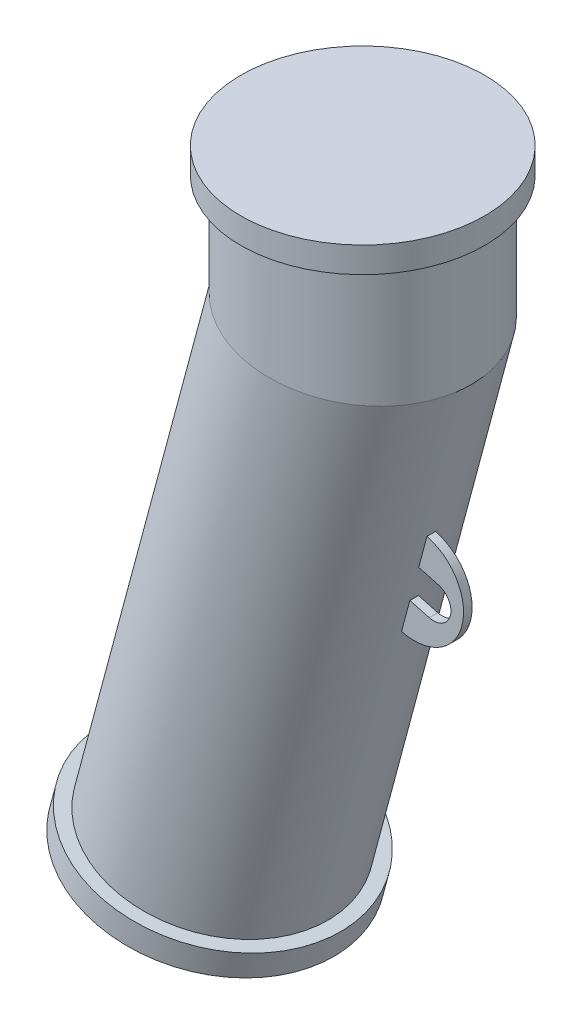
ISO-10303-21;
HEADER;
FILE_DESCRIPTION(('STEP AP214'),'2;1');
FILE_NAME('part.step','',(''),(''),'','','');
FILE_SCHEMA(('AUTOMOTIVE_DESIGN { 1 0 10303 214 1 1 1 1 }'));
ENDSEC;
DATA;
#1=APPLICATION_CONTEXT('core data for automotive mechanical design processes');
#2=APPLICATION_PROTOCOL_DEFINITION('international standard','automotive_design',2000,#1);
#3=PRODUCT_CONTEXT('',#1,'mechanical');
#4=PRODUCT('Part','Part','',(#3));
#5=PRODUCT_RELATED_PRODUCT_CATEGORY('part','',(#4));
#6=PRODUCT_DEFINITION_FORMATION('','',#4);
#7=PRODUCT_DEFINITION_CONTEXT('part definition',#1,'design');
#8=PRODUCT_DEFINITION('design','',#6,#7);
#9=PRODUCT_DEFINITION_SHAPE('','',#8);
#10=(LENGTH_UNIT() NAMED_UNIT(*) SI_UNIT(.MILLI.,.METRE.));
#11=(NAMED_UNIT(*) PLANE_ANGLE_UNIT() SI_UNIT($,.RADIAN.));
#12=(NAMED_UNIT(*) SI_UNIT($,.STERADIAN.) SOLID_ANGLE_UNIT());
#13=UNCERTAINTY_MEASURE_WITH_UNIT(LENGTH_MEASURE(1.E-05),#10,'distance_accuracy_value','');
#14=(GEOMETRIC_REPRESENTATION_CONTEXT(3) GLOBAL_UNCERTAINTY_ASSIGNED_CONTEXT((#13)) GLOBAL_UNIT_ASSIGNED_CONTEXT((#10,
#11,#12)) REPRESENTATION_CONTEXT('',''));
#15=CARTESIAN_POINT('',(0.,0.,0.));
#16=DIRECTION('',(0.,0.,1.));
#17=DIRECTION('',(1.,0.,0.));
#18=AXIS2_PLACEMENT_3D('',#15,#16,#17);
#19=CARTESIAN_POINT('',(0.,-131.652497587396,0.));
#20=DIRECTION('',(0.,1.,0.));
#21=DIRECTION('',(0.,0.,1.));
#22=AXIS2_PLACEMENT_3D('',#19,#20,#21);
#23=CYLINDRICAL_SURFACE('',#22,127.);
#24=CARTESIAN_POINT('',(0.,0.,0.));
#25=DIRECTION('',(0.,-1.,0.));
#26=DIRECTION('',(0.,0.,-1.));
#27=AXIS2_PLACEMENT_3D('',#24,#25,#26);
#28=CIRCLE('',#27,127.);
#29=CARTESIAN_POINT('',(0.,0.,-127.));
#30=VERTEX_POINT('',#29);
#31=EDGE_CURVE('E313',#30,#30,#28,.T.);
#32=ORIENTED_EDGE('',*,*,#31,.T.);
#33=EDGE_LOOP('',(#32));
#34=FACE_BOUND('',#33,.T.);
#35=CARTESIAN_POINT('',(1.04083408558608E-13,-131.652497587397,0.));
#36=DIRECTION('',(0.130526192220052,0.991444861373811,0.));
#37=DIRECTION('',(0.991444861373811,-0.130526192220052,0.));
#38=AXIS2_PLACEMENT_3D('',#35,#36,#37);
#39=ELLIPSE('',#38,128.095877993679,127.);
#40=CARTESIAN_POINT('',(127.,-148.372364780996,0.));
#41=VERTEX_POINT('',#40);
#42=EDGE_CURVE('E321',#41,#41,#39,.T.);
#43=ORIENTED_EDGE('',*,*,#42,.T.);
#44=EDGE_LOOP('',(#43));
#45=FACE_BOUND('',#44,.T.);
#46=ADVANCED_FACE('F17',(#34,#45),#23,.T.);
#47=CARTESIAN_POINT('',(-95.6613645989107,-759.954897245026,29.0839408597498));
#48=DIRECTION('',(-0.258819045102509,-0.965925826289071,0.));
#49=DIRECTION('',(0.369643810614398,-0.0990457605412854,-0.923879532511311));
#50=AXIS2_PLACEMENT_3D('',#47,#48,#49);
#51=PLANE('',#50);
#52=CARTESIAN_POINT('',(-163.483696262193,-741.781958247057,0.));
#53=DIRECTION('',(-0.258819045102522,-0.965925826289069,0.));
#54=DIRECTION('',(0.,0.,-1.));
#55=AXIS2_PLACEMENT_3D('',#52,#53,#54);
#56=CIRCLE('',#55,127.);
#57=CARTESIAN_POINT('',(-163.483696262193,-741.781958247057,-127.));
#58=VERTEX_POINT('',#57);
#59=EDGE_CURVE('E317',#58,#58,#56,.T.);
#60=ORIENTED_EDGE('',*,*,#59,.T.);
#61=EDGE_LOOP('',(#60));
#62=FACE_BOUND('',#61,.T.);
#63=CARTESIAN_POINT('',(-163.483696262181,-741.781958247051,1.54839771410055E-12));
#64=DIRECTION('',(0.258819045102509,0.965925826289071,0.));
#65=DIRECTION('',(-0.369643810614398,0.0990457605412854,0.923879532511311));
#66=AXIS2_PLACEMENT_3D('',#63,#64,#65);
#67=CIRCLE('',#66,142.5);
#68=CARTESIAN_POINT('',(-216.157939274733,-727.667937369918,131.652833382863));
#69=VERTEX_POINT('',#68);
#70=EDGE_CURVE('E309',#69,#69,#67,.T.);
#71=ORIENTED_EDGE('',*,*,#70,.T.);
#72=EDGE_LOOP('',(#71));
#73=FACE_BOUND('',#72,.T.);
#74=ADVANCED_FACE('F392',(#62,#73),#51,.F.);
#75=CARTESIAN_POINT('',(-163.483696262181,-741.781958247051,1.54839771410055E-12));
#76=DIRECTION('',(0.258819045102509,0.965925826289071,0.));
#77=DIRECTION('',(-0.369643810614398,0.0990457605412854,0.923879532511311));
#78=AXIS2_PLACEMENT_3D('',#75,#76,#77);
#79=CYLINDRICAL_SURFACE('',#78,142.5);
#80=ORIENTED_EDGE('',*,*,#70,.F.);
#81=EDGE_LOOP('',(#80));
#82=FACE_BOUND('',#81,.T.);
#83=CARTESIAN_POINT('',(-171.248267615256,-770.759733035724,2.84822651057021E-12));
#84=DIRECTION('',(0.258819045102509,0.965925826289071,0.));
#85=DIRECTION('',(-0.369643810614398,0.0990457605412854,0.923879532511311));
#86=AXIS2_PLACEMENT_3D('',#83,#84,#85);
#87=CIRCLE('',#86,142.5);
#88=CARTESIAN_POINT('',(-223.922510627808,-756.645712158591,131.652833382865));
#89=VERTEX_POINT('',#88);
#90=EDGE_CURVE('E305',#89,#89,#87,.T.);
#91=ORIENTED_EDGE('',*,*,#90,.T.);
#92=EDGE_LOOP('',(#91));
#93=FACE_BOUND('',#92,.T.);
#94=ADVANCED_FACE('F398',(#82,#93),#79,.T.);
#95=CARTESIAN_POINT('',(-44.0813957466201,-804.833993656921,54.5323891120309));
#96=DIRECTION('',(0.258819045102509,0.965925826289071,0.));
#97=DIRECTION('',(-0.369643810614398,0.0990457605412854,0.923879532511311));
#98=AXIS2_PLACEMENT_3D('',#95,#96,#97);
#99=PLANE('',#98);
#100=ORIENTED_EDGE('',*,*,#90,.F.);
#101=EDGE_LOOP('',(#100));
#102=FACE_BOUND('',#101,.T.);
#103=ADVANCED_FACE('F404',(#102),#99,.F.);
#104=CARTESIAN_POINT('',(-70.2148444708591,7.111762575851E-12,-29.0839408597463));
#105=DIRECTION('',(0.,0.999999999999999,0.));
#106=DIRECTION('',(0.382683432365101,0.,-0.923879532511311));
#107=AXIS2_PLACEMENT_3D('',#104,#105,#106);
#108=PLANE('',#107);
#109=ORIENTED_EDGE('',*,*,#31,.F.);
#110=EDGE_LOOP('',(#109));
#111=FACE_BOUND('',#110,.T.);
#112=CARTESIAN_POINT('',(0.,0.,0.));
#113=DIRECTION('',(0.,-0.999999999999999,0.));
#114=DIRECTION('',(-0.382683432365101,0.,0.923879532511311));
#115=AXIS2_PLACEMENT_3D('',#112,#113,#114);
#116=CIRCLE('',#115,142.5);
#117=CARTESIAN_POINT('',(-54.5323891120268,0.,131.652833382862));
#118=VERTEX_POINT('',#117);
#119=EDGE_CURVE('E301',#118,#118,#116,.T.);
#120=ORIENTED_EDGE('',*,*,#119,.T.);
#121=EDGE_LOOP('',(#120));
#122=FACE_BOUND('',#121,.T.);
#123=ADVANCED_FACE('F408',(#111,#122),#108,.F.);
#124=CARTESIAN_POINT('',(0.,0.,0.));
#125=DIRECTION('',(0.,-0.999999999999999,0.));
#126=DIRECTION('',(-0.382683432365101,0.,0.923879532511311));
#127=AXIS2_PLACEMENT_3D('',#124,#125,#126);
#128=CYLINDRICAL_SURFACE('',#127,142.5);
#129=ORIENTED_EDGE('',*,*,#119,.F.);
#130=EDGE_LOOP('',(#129));
#131=FACE_BOUND('',#130,.T.);
#132=CARTESIAN_POINT('',(-1.51753841493357E-12,30.0000000000011,3.33871122390185E-13));
#133=DIRECTION('',(0.,-0.999999999999999,0.));
#134=DIRECTION('',(-0.382683432365101,0.,0.923879532511311));
#135=AXIS2_PLACEMENT_3D('',#132,#133,#134);
#136=CIRCLE('',#135,142.5);
#137=CARTESIAN_POINT('',(-54.5323891120284,30.0000000000011,131.652833382862));
#138=VERTEX_POINT('',#137);
#139=EDGE_CURVE('E297',#138,#138,#136,.T.);
#140=ORIENTED_EDGE('',*,*,#139,.T.);
#141=EDGE_LOOP('',(#140));
#142=FACE_BOUND('',#141,.T.);
#143=ADVANCED_FACE('F412',(#131,#142),#128,.T.);
#144=CARTESIAN_POINT('',(-131.652833382864,30.0000000000066,-54.5323891120249));
#145=DIRECTION('',(0.,-0.999999999999999,0.));
#146=DIRECTION('',(-0.382683432365101,0.,0.923879532511311));
#147=AXIS2_PLACEMENT_3D('',#144,#145,#146);
#148=PLANE('',#147);
#149=ORIENTED_EDGE('',*,*,#139,.F.);
#150=EDGE_LOOP('',(#149));
#151=FACE_BOUND('',#150,.T.);
#152=ADVANCED_FACE('F386',(#151),#148,.F.);
#153=CARTESIAN_POINT('',(-163.483696262193,-741.781958247057,0.));
#154=DIRECTION('',(0.258819045102522,0.965925826289069,0.));
#155=DIRECTION('',(-0.965925826289069,0.258819045102522,0.));
#156=AXIS2_PLACEMENT_3D('',#153,#154,#155);
#157=CYLINDRICAL_SURFACE('',#156,127.);
#158=CARTESIAN_POINT('',(50.327510586392,-434.137557581643,5.00000000000004));
#159=CARTESIAN_POINT('',(50.3909015789029,-434.154601332666,3.33333333333338));
#160=CARTESIAN_POINT('',(50.4225970751584,-434.163123208177,1.66666666666671));
#161=CARTESIAN_POINT('',(50.4225970751584,-434.163123208177,-1.66666666666662));
#162=CARTESIAN_POINT('',(50.390901578903,-434.154601332666,-3.33333333333329));
#163=CARTESIAN_POINT('',(50.327510586392,-434.137557581643,-4.99999999999996));
#164=B_SPLINE_CURVE_WITH_KNOTS('',3,(#158,#159,#160,#161,#162,#163),.UNSPECIFIED.,.F.,.F.,(4,2,
4),(0.,5.00096941018499,10.00193882037),.UNSPECIFIED.);
#165=CARTESIAN_POINT('',(50.327510586392,-434.137557581643,5.00000000000004));
#166=VERTEX_POINT('',#165);
#167=CARTESIAN_POINT('',(50.3275105863922,-434.137557581643,-4.99999999999996));
#168=VERTEX_POINT('',#167);
#169=EDGE_CURVE('E47',#166,#168,#164,.T.);
#170=ORIENTED_EDGE('',*,*,#169,.F.);
#171=DIRECTION('',(0.258819045102522,0.965925826289069,0.));
#172=VECTOR('',#171,1.);
#173=CARTESIAN_POINT('',(-40.906224631912,-774.626492780639,5.00000000000014));
#174=LINE('',#173,#172);
#175=CARTESIAN_POINT('',(60.0332029580722,-397.9154205279,5.00000000000007));
#176=VERTEX_POINT('',#175);
#177=EDGE_CURVE('E10',#166,#176,#174,.T.);
#178=ORIENTED_EDGE('',*,*,#177,.T.);
#179=CARTESIAN_POINT('',(-62.5442686722091,-365.070885994318,0.));
#180=DIRECTION('',(-0.25881904510251,-0.965925826289072,0.));
#181=DIRECTION('',(0.965925826289071,-0.25881904510251,0.));
#182=AXIS2_PLACEMENT_3D('',#179,#180,#181);
#183=CIRCLE('',#182,127.);
#184=CARTESIAN_POINT('',(60.0332029580724,-397.915420527899,-4.99999999999991));
#185=VERTEX_POINT('',#184);
#186=EDGE_CURVE('E22',#185,#176,#183,.T.);
#187=ORIENTED_EDGE('',*,*,#186,.F.);
#188=DIRECTION('',(0.258819045102522,0.965925826289069,0.));
#189=VECTOR('',#188,1.);
#190=CARTESIAN_POINT('',(-40.906224631912,-774.626492780639,-4.99999999999986));
#191=LINE('',#190,#189);
#192=EDGE_CURVE('E330',#168,#185,#191,.T.);
#193=ORIENTED_EDGE('',*,*,#192,.F.);
#194=EDGE_LOOP('',(#170,#178,#187,#193));
#195=FACE_BOUND('',#194,.T.);
#196=CARTESIAN_POINT('',(-52.1915068681081,-326.433852942755,0.));
#197=DIRECTION('',(0.258819045102511,0.965925826289072,0.));
#198=DIRECTION('',(-0.965925826289071,0.25881904510251,0.));
#199=AXIS2_PLACEMENT_3D('',#196,#197,#198);
#200=CIRCLE('',#199,127.);
#201=CARTESIAN_POINT('',(70.3859647621732,-359.278387476337,5.00000000000006));
#202=VERTEX_POINT('',#201);
#203=CARTESIAN_POINT('',(70.3859647621733,-359.278387476336,-4.99999999999992));
#204=VERTEX_POINT('',#203);
#205=EDGE_CURVE('E338',#202,#204,#200,.T.);
#206=ORIENTED_EDGE('',*,*,#205,.F.);
#207=CARTESIAN_POINT('',(80.0916571338531,-323.056250422593,5.00000000000004));
#208=VERTEX_POINT('',#207);
#209=EDGE_CURVE('E30',#202,#208,#174,.T.);
#210=ORIENTED_EDGE('',*,*,#209,.T.);
#211=CARTESIAN_POINT('',(80.0916571338531,-323.056250422593,-4.99999999999996));
#212=CARTESIAN_POINT('',(80.15507721925,-323.073185597487,-3.33333333333329));
#213=CARTESIAN_POINT('',(80.1867872619484,-323.081653184934,-1.66666666666663));
#214=CARTESIAN_POINT('',(80.1867872619484,-323.081653184934,1.66666666666671));
#215=CARTESIAN_POINT('',(80.15507721925,-323.073185597487,3.33333333333337));
#216=CARTESIAN_POINT('',(80.0916571338531,-323.056250422593,5.00000000000004));
#217=B_SPLINE_CURVE_WITH_KNOTS('',3,(#211,#212,#213,#214,#215,#216),.UNSPECIFIED.,.F.,.F.,(4,2,
4),(0.,5.00096941018499,10.00193882037),.UNSPECIFIED.);
#218=CARTESIAN_POINT('',(80.0916571338533,-323.056250422593,-4.99999999999996));
#219=VERTEX_POINT('',#218);
#220=EDGE_CURVE('E329',#219,#208,#217,.T.);
#221=ORIENTED_EDGE('',*,*,#220,.F.);
#222=EDGE_CURVE('E325',#204,#219,#191,.T.);
#223=ORIENTED_EDGE('',*,*,#222,.F.);
#224=EDGE_LOOP('',(#206,#210,#221,#223));
#225=FACE_BOUND('',#224,.T.);
#226=ORIENTED_EDGE('',*,*,#59,.F.);
#227=EDGE_LOOP('',(#226));
#228=FACE_BOUND('',#227,.T.);
#229=ORIENTED_EDGE('',*,*,#42,.F.);
#230=EDGE_LOOP('',(#229));
#231=FACE_BOUND('',#230,.T.);
#232=ADVANCED_FACE('F19',(#195,#225,#228,#231),#157,.T.);
#233=CARTESIAN_POINT('',(65.3046921685574,-378.622388196557,5.00000000000004));
#234=DIRECTION('',(0.,0.,-1.));
#235=DIRECTION('',(-0.965925826289072,0.258819045102511,0.));
#236=AXIS2_PLACEMENT_3D('',#233,#234,#235);
#237=CYLINDRICAL_SURFACE('',#236,57.5);
#238=CARTESIAN_POINT('',(65.3046921685574,-378.622388196557,5.00000000000004));
#239=DIRECTION('',(0.,0.,1.));
#240=DIRECTION('',(0.965925826289072,-0.258819045102511,0.));
#241=AXIS2_PLACEMENT_3D('',#238,#239,#240);
#242=CIRCLE('',#241,57.5);
#243=EDGE_CURVE('E274',#166,#208,#242,.T.);
#244=ORIENTED_EDGE('',*,*,#243,.F.);
#245=ORIENTED_EDGE('',*,*,#169,.T.);
#246=CARTESIAN_POINT('',(65.3046921685574,-378.622388196557,-4.99999999999996));
#247=DIRECTION('',(0.,0.,1.));
#248=DIRECTION('',(0.965925826289072,-0.258819045102511,0.));
#249=AXIS2_PLACEMENT_3D('',#246,#247,#248);
#250=CIRCLE('',#249,57.5);
#251=EDGE_CURVE('E267',#168,#219,#250,.T.);
#252=ORIENTED_EDGE('',*,*,#251,.T.);
#253=ORIENTED_EDGE('',*,*,#220,.T.);
#254=EDGE_LOOP('',(#244,#245,#252,#253));
#255=FACE_BOUND('',#254,.T.);
#256=ADVANCED_FACE('F339',(#255),#237,.T.);
#257=CARTESIAN_POINT('',(88.0039490863505,-384.704635756466,5.00000000000003));
#258=DIRECTION('',(0.,0.,1.));
#259=DIRECTION('',(0.965925826289072,-0.258819045102511,0.));
#260=AXIS2_PLACEMENT_3D('',#257,#258,#259);
#261=PLANE('',#260);
#262=ORIENTED_EDGE('',*,*,#177,.F.);
#263=ORIENTED_EDGE('',*,*,#243,.T.);
#264=ORIENTED_EDGE('',*,*,#209,.F.);
#265=DIRECTION('',(0.965925826289072,-0.258819045102511,0.));
#266=VECTOR('',#265,1.);
#267=CARTESIAN_POINT('',(70.4810730706075,-359.303871670775,5.00000000000004));
#268=LINE('',#267,#266);
#269=CARTESIAN_POINT('',(93.1803299884007,-365.386119230684,5.00000000000002));
#270=VERTEX_POINT('',#269);
#271=EDGE_CURVE('E263',#202,#270,#268,.T.);
#272=ORIENTED_EDGE('',*,*,#271,.T.);
#273=CARTESIAN_POINT('',(88.0039490863505,-384.704635756466,5.00000000000003));
#274=DIRECTION('',(0.,0.,-1.));
#275=DIRECTION('',(0.965925826289072,-0.258819045102511,0.));
#276=AXIS2_PLACEMENT_3D('',#273,#274,#275);
#277=CIRCLE('',#276,20.);
#278=CARTESIAN_POINT('',(82.8275681843003,-404.023152282247,5.00000000000003));
#279=VERTEX_POINT('',#278);
#280=EDGE_CURVE('E266',#270,#279,#277,.T.);
#281=ORIENTED_EDGE('',*,*,#280,.T.);
#282=DIRECTION('',(-0.965925826289072,0.25881904510251,0.));
#283=VECTOR('',#282,1.);
#284=CARTESIAN_POINT('',(60.128311266507,-397.940904722338,5.00000000000005));
#285=LINE('',#284,#283);
#286=EDGE_CURVE('E270',#279,#176,#285,.T.);
#287=ORIENTED_EDGE('',*,*,#286,.T.);
#288=EDGE_LOOP('',(#262,#263,#264,#272,#281,#287));
#289=FACE_BOUND('',#288,.T.);
#290=ADVANCED_FACE('F344',(#289),#261,.T.);
#291=CARTESIAN_POINT('',(88.0039490863504,-384.704635756466,-4.99999999999998));
#292=DIRECTION('',(0.,0.,1.));
#293=DIRECTION('',(0.965925826289072,-0.258819045102511,0.));
#294=AXIS2_PLACEMENT_3D('',#291,#292,#293);
#295=PLANE('',#294);
#296=ORIENTED_EDGE('',*,*,#251,.F.);
#297=ORIENTED_EDGE('',*,*,#192,.T.);
#298=DIRECTION('',(-0.965925826289072,0.25881904510251,0.));
#299=VECTOR('',#298,1.);
#300=CARTESIAN_POINT('',(60.128311266507,-397.940904722338,-4.99999999999995));
#301=LINE('',#300,#299);
#302=CARTESIAN_POINT('',(82.8275681843003,-404.023152282247,-4.99999999999997));
#303=VERTEX_POINT('',#302);
#304=EDGE_CURVE('E284',#303,#185,#301,.T.);
#305=ORIENTED_EDGE('',*,*,#304,.F.);
#306=CARTESIAN_POINT('',(88.0039490863504,-384.704635756466,-4.99999999999998));
#307=DIRECTION('',(0.,0.,-1.));
#308=DIRECTION('',(0.965925826289072,-0.258819045102511,0.));
#309=AXIS2_PLACEMENT_3D('',#306,#307,#308);
#310=CIRCLE('',#309,20.);
#311=CARTESIAN_POINT('',(93.1803299884007,-365.386119230684,-4.99999999999998));
#312=VERTEX_POINT('',#311);
#313=EDGE_CURVE('E281',#312,#303,#310,.T.);
#314=ORIENTED_EDGE('',*,*,#313,.F.);
#315=DIRECTION('',(0.965925826289072,-0.258819045102511,0.));
#316=VECTOR('',#315,1.);
#317=CARTESIAN_POINT('',(70.4810730706074,-359.303871670775,-4.99999999999996));
#318=LINE('',#317,#316);
#319=EDGE_CURVE('E259',#204,#312,#318,.T.);
#320=ORIENTED_EDGE('',*,*,#319,.F.);
#321=ORIENTED_EDGE('',*,*,#222,.T.);
#322=EDGE_LOOP('',(#296,#297,#305,#314,#320,#321));
#323=FACE_BOUND('',#322,.T.);
#324=ADVANCED_FACE('F346',(#323),#295,.F.);
#325=CARTESIAN_POINT('',(70.4810730706075,-359.303871670775,5.00000000000004));
#326=DIRECTION('',(0.258819045102511,0.965925826289072,0.));
#327=DIRECTION('',(-0.965925826289072,0.258819045102511,0.));
#328=AXIS2_PLACEMENT_3D('',#325,#326,#327);
#329=PLANE('',#328);
#330=ORIENTED_EDGE('',*,*,#271,.F.);
#331=ORIENTED_EDGE('',*,*,#205,.T.);
#332=ORIENTED_EDGE('',*,*,#319,.T.);
#333=DIRECTION('',(0.,0.,-1.));
#334=VECTOR('',#333,1.);
#335=CARTESIAN_POINT('',(93.1803299884007,-365.386119230684,5.00000000000002));
#336=LINE('',#335,#334);
#337=EDGE_CURVE('E293',#270,#312,#336,.T.);
#338=ORIENTED_EDGE('',*,*,#337,.F.);
#339=EDGE_LOOP('',(#330,#331,#332,#338));
#340=FACE_BOUND('',#339,.T.);
#341=ADVANCED_FACE('F370',(#340),#329,.F.);
#342=CARTESIAN_POINT('',(88.0039490863505,-384.704635756466,5.00000000000003));
#343=DIRECTION('',(0.,0.,-1.));
#344=DIRECTION('',(-0.965925826289072,0.258819045102511,0.));
#345=AXIS2_PLACEMENT_3D('',#342,#343,#344);
#346=CYLINDRICAL_SURFACE('',#345,20.);
#347=ORIENTED_EDGE('',*,*,#313,.T.);
#348=DIRECTION('',(0.,0.,-1.));
#349=VECTOR('',#348,1.);
#350=CARTESIAN_POINT('',(82.8275681843003,-404.023152282247,5.00000000000003));
#351=LINE('',#350,#349);
#352=EDGE_CURVE('E278',#279,#303,#351,.T.);
#353=ORIENTED_EDGE('',*,*,#352,.F.);
#354=ORIENTED_EDGE('',*,*,#280,.F.);
#355=ORIENTED_EDGE('',*,*,#337,.T.);
#356=EDGE_LOOP('',(#347,#353,#354,#355));
#357=FACE_BOUND('',#356,.T.);
#358=ADVANCED_FACE('F378',(#357),#346,.F.);
#359=CARTESIAN_POINT('',(60.128311266507,-397.940904722338,5.00000000000005));
#360=DIRECTION('',(-0.25881904510251,-0.965925826289072,0.));
#361=DIRECTION('',(0.965925826289072,-0.25881904510251,0.));
#362=AXIS2_PLACEMENT_3D('',#359,#360,#361);
#363=PLANE('',#362);
#364=ORIENTED_EDGE('',*,*,#304,.T.);
#365=ORIENTED_EDGE('',*,*,#186,.T.);
#366=ORIENTED_EDGE('',*,*,#286,.F.);
#367=ORIENTED_EDGE('',*,*,#352,.T.);
#368=EDGE_LOOP('',(#364,#365,#366,#367));
#369=FACE_BOUND('',#368,.T.);
#370=ADVANCED_FACE('F348',(#369),#363,.F.);
#371=CLOSED_SHELL('',(#46,#74,#94,#103,#123,#143,#152,#232,#256,#290,#324,#341,#358,#370));
#372=CARTESIAN_POINT('',(-164.777791487695,-746.611587378503,2.7880658045752E-12));
#373=DIRECTION('',(-0.258819045102509,-0.965925826289071,0.));
#374=DIRECTION('',(0.965925826289071,-0.258819045102509,0.));
#375=AXIS2_PLACEMENT_3D('',#372,#373,#374);
#376=PLANE('',#375);
#377=CARTESIAN_POINT('',(-164.777791487695,-746.611587378503,1.56042985529957E-12));
#378=DIRECTION('',(-0.258819045102509,-0.965925826289071,0.));
#379=DIRECTION('',(0.965925826289071,-0.258819045102509,0.));
#380=AXIS2_PLACEMENT_3D('',#377,#378,#379);
#381=CIRCLE('',#380,76.);
#382=CARTESIAN_POINT('',(-91.367428689726,-766.281834806293,1.56042985529957E-12));
#383=VERTEX_POINT('',#382);
#384=EDGE_CURVE('E193',#383,#383,#381,.F.);
#385=ORIENTED_EDGE('',*,*,#384,.T.);
#386=EDGE_LOOP('',(#385));
#387=FACE_BOUND('',#386,.T.);
#388=ADVANCED_FACE('F432',(#387),#376,.F.);
#389=CARTESIAN_POINT('',(-1.48167048963857E-12,5.00000000000664,2.73680607517381E-13));
#390=DIRECTION('',(0.,1.,0.));
#391=DIRECTION('',(0.,0.,1.));
#392=AXIS2_PLACEMENT_3D('',#389,#390,#391);
#393=PLANE('',#392);
#394=CARTESIAN_POINT('',(0.,5.00000000000664,0.));
#395=DIRECTION('',(0.,1.,0.));
#396=DIRECTION('',(0.,0.,1.));
#397=AXIS2_PLACEMENT_3D('',#394,#395,#396);
#398=CIRCLE('',#397,76.);
#399=CARTESIAN_POINT('',(0.,5.00000000000646,76.));
#400=VERTEX_POINT('',#399);
#401=EDGE_CURVE('E180',#400,#400,#398,.F.);
#402=ORIENTED_EDGE('',*,*,#401,.T.);
#403=EDGE_LOOP('',(#402));
#404=FACE_BOUND('',#403,.T.);
#405=ADVANCED_FACE('F436',(#404),#393,.F.);
#406=CARTESIAN_POINT('',(0.,0.,0.));
#407=DIRECTION('',(0.,-0.999999999999999,0.));
#408=DIRECTION('',(-0.382683432365101,0.,0.923879532511311));
#409=AXIS2_PLACEMENT_3D('',#406,#407,#408);
#410=CYLINDRICAL_SURFACE('',#409,76.);
#411=CARTESIAN_POINT('',(0.,2.00000000000111,0.));
#412=DIRECTION('',(0.,0.999999999999999,0.));
#413=DIRECTION('',(0.382683432365101,0.,-0.923879532511311));
#414=AXIS2_PLACEMENT_3D('',#411,#412,#413);
#415=CIRCLE('',#414,76.);
#416=CARTESIAN_POINT('',(29.0839408597476,2.00000000000112,-70.2148444708596));
#417=VERTEX_POINT('',#416);
#418=EDGE_CURVE('E194',#417,#417,#415,.F.);
#419=ORIENTED_EDGE('',*,*,#418,.T.);
#420=EDGE_LOOP('',(#419));
#421=FACE_BOUND('',#420,.T.);
#422=ORIENTED_EDGE('',*,*,#401,.F.);
#423=EDGE_LOOP('',(#422));
#424=FACE_BOUND('',#423,.T.);
#425=ADVANCED_FACE('F446',(#421,#424),#410,.F.);
#426=CARTESIAN_POINT('',(0.,2.00000000000111,0.));
#427=DIRECTION('',(0.,-0.999999999999999,0.));
#428=DIRECTION('',(-0.382683432365101,0.,0.923879532511311));
#429=AXIS2_PLACEMENT_3D('',#426,#427,#428);
#430=CONICAL_SURFACE('',#429,76.,0.785398163397438);
#431=CARTESIAN_POINT('',(0.,1.80000000000112,0.));
#432=DIRECTION('',(0.,-0.999999999999999,0.));
#433=DIRECTION('',(0.,0.,-1.));
#434=AXIS2_PLACEMENT_3D('',#431,#432,#433);
#435=CIRCLE('',#434,76.2);
#436=CARTESIAN_POINT('',(0.,1.8000000000013,-76.2));
#437=VERTEX_POINT('',#436);
#438=EDGE_CURVE('E199',#437,#437,#435,.F.);
#439=ORIENTED_EDGE('',*,*,#438,.F.);
#440=EDGE_LOOP('',(#439));
#441=FACE_BOUND('',#440,.T.);
#442=ORIENTED_EDGE('',*,*,#418,.F.);
#443=EDGE_LOOP('',(#442));
#444=FACE_BOUND('',#443,.T.);
#445=ADVANCED_FACE('F455',(#441,#444),#430,.F.);
#446=CARTESIAN_POINT('',(0.,10.,0.));
#447=DIRECTION('',(0.,-1.,0.));
#448=DIRECTION('',(1.,0.,0.));
#449=AXIS2_PLACEMENT_3D('',#446,#447,#448);
#450=CYLINDRICAL_SURFACE('',#449,76.2);
#451=ORIENTED_EDGE('',*,*,#438,.T.);
#452=EDGE_LOOP('',(#451));
#453=FACE_BOUND('',#452,.T.);
#454=CARTESIAN_POINT('',(0.,0.,0.));
#455=DIRECTION('',(0.,-1.,0.));
#456=DIRECTION('',(1.,0.,0.));
#457=AXIS2_PLACEMENT_3D('',#454,#455,#456);
#458=CIRCLE('',#457,76.2);
#459=CARTESIAN_POINT('',(76.2,0.,0.));
#460=VERTEX_POINT('',#459);
#461=EDGE_CURVE('E208',#460,#460,#458,.T.);
#462=ORIENTED_EDGE('',*,*,#461,.T.);
#463=EDGE_LOOP('',(#462));
#464=FACE_BOUND('',#463,.T.);
#465=ADVANCED_FACE('F465',(#453,#464),#450,.F.);
#466=CARTESIAN_POINT('',(-1000.,0.,0.));
#467=DIRECTION('',(0.,0.,-1.));
#468=DIRECTION('',(0.,1.,0.));
#469=AXIS2_PLACEMENT_3D('',#466,#467,#468);
#470=TOROIDAL_SURFACE('',#469,1000.,76.2);
#471=CARTESIAN_POINT('',(-34.0741737109319,-258.819045102521,0.));
#472=DIRECTION('',(0.258819045102521,0.965925826289068,0.));
#473=DIRECTION('',(0.933012701892219,-0.250000000000001,-0.258819045102521));
#474=AXIS2_PLACEMENT_3D('',#471,#472,#473);
#475=CIRCLE('',#474,76.2);
#476=CARTESIAN_POINT('',(39.5293742522951,-278.541056339334,0.));
#477=VERTEX_POINT('',#476);
#478=EDGE_CURVE('E198',#477,#477,#475,.T.);
#479=CARTESIAN_POINT('',(-1000.,0.,0.));
#480=DIRECTION('',(0.,0.,-1.));
#481=DIRECTION('',(0.,1.,0.));
#482=AXIS2_PLACEMENT_3D('',#479,#480,#481);
#483=CIRCLE('',#482,1076.2);
#484=EDGE_CURVE('',#460,#477,#483,.T.);
#485=ORIENTED_EDGE('',*,*,#461,.F.);
#486=ORIENTED_EDGE('',*,*,#478,.F.);
#487=ORIENTED_EDGE('',*,*,#484,.T.);
#488=ORIENTED_EDGE('',*,*,#484,.F.);
#489=EDGE_LOOP('',(#485,#487,#486,#488));
#490=FACE_BOUND('',#489,.T.);
#491=ADVANCED_FACE('F474',(#490),#470,.F.);
#492=CARTESIAN_POINT('',(-34.0741737109319,-258.819045102521,0.));
#493=DIRECTION('',(-0.258819045102521,-0.965925826289068,0.));
#494=DIRECTION('',(-0.933012701892219,0.250000000000001,0.258819045102521));
#495=AXIS2_PLACEMENT_3D('',#492,#493,#494);
#496=CYLINDRICAL_SURFACE('',#495,76.2);
#497=ORIENTED_EDGE('',*,*,#478,.T.);
#498=EDGE_LOOP('',(#497));
#499=FACE_BOUND('',#498,.T.);
#500=CARTESIAN_POINT('',(-163.949570543366,-743.520624734372,1.55956557339756E-12));
#501=DIRECTION('',(0.258819045102509,0.965925826289071,0.));
#502=DIRECTION('',(-0.965925826289072,0.258819045102509,0.));
#503=AXIS2_PLACEMENT_3D('',#500,#501,#502);
#504=CIRCLE('',#503,76.2);
#505=CARTESIAN_POINT('',(-237.553118506593,-723.798613497561,1.55956557339756E-12));
#506=VERTEX_POINT('',#505);
#507=EDGE_CURVE('E204',#506,#506,#504,.F.);
#508=ORIENTED_EDGE('',*,*,#507,.T.);
#509=EDGE_LOOP('',(#508));
#510=FACE_BOUND('',#509,.T.);
#511=ADVANCED_FACE('F483',(#499,#510),#496,.F.);
#512=CARTESIAN_POINT('',(-164.001334352387,-743.71380989963,1.56004685904552E-12));
#513=DIRECTION('',(0.258819045102509,0.965925826289071,0.));
#514=DIRECTION('',(-0.369643810614398,0.0990457605412854,0.923879532511311));
#515=AXIS2_PLACEMENT_3D('',#512,#513,#514);
#516=CONICAL_SURFACE('',#515,76.,0.785398163397438);
#517=ORIENTED_EDGE('',*,*,#507,.F.);
#518=EDGE_LOOP('',(#517));
#519=FACE_BOUND('',#518,.T.);
#520=CARTESIAN_POINT('',(-164.001334352387,-743.71380989963,1.56004685904552E-12));
#521=DIRECTION('',(-0.258819045102509,-0.965925826289071,0.));
#522=DIRECTION('',(0.369643810614398,-0.0990457605412854,-0.923879532511311));
#523=AXIS2_PLACEMENT_3D('',#520,#521,#522);
#524=CIRCLE('',#523,76.);
#525=CARTESIAN_POINT('',(-135.908404745692,-751.241287700768,-70.2148444708581));
#526=VERTEX_POINT('',#525);
#527=EDGE_CURVE('E200',#526,#526,#524,.F.);
#528=ORIENTED_EDGE('',*,*,#527,.F.);
#529=EDGE_LOOP('',(#528));
#530=FACE_BOUND('',#529,.T.);
#531=ADVANCED_FACE('F491',(#519,#530),#516,.F.);
#532=CARTESIAN_POINT('',(-163.483696262181,-741.781958247051,1.54839771410055E-12));
#533=DIRECTION('',(0.258819045102509,0.965925826289071,0.));
#534=DIRECTION('',(-0.369643810614398,0.0990457605412854,0.923879532511311));
#535=AXIS2_PLACEMENT_3D('',#532,#533,#534);
#536=CYLINDRICAL_SURFACE('',#535,76.);
#537=ORIENTED_EDGE('',*,*,#527,.T.);
#538=EDGE_LOOP('',(#537));
#539=FACE_BOUND('',#538,.T.);
#540=ORIENTED_EDGE('',*,*,#384,.F.);
#541=EDGE_LOOP('',(#540));
#542=FACE_BOUND('',#541,.T.);
#543=ADVANCED_FACE('F500',(#539,#542),#536,.F.);
#544=CLOSED_SHELL('',(#388,#405,#425,#445,#465,#491,#511,#531,#543));
#545=CARTESIAN_POINT('',(45.9220118838098,5.00000000000644,110.865543901359));
#546=DIRECTION('',(0.,1.,0.));
#547=DIRECTION('',(0.,0.,1.));
#548=AXIS2_PLACEMENT_3D('',#545,#546,#547);
#549=PLANE('',#548);
#550=CARTESIAN_POINT('',(45.9220118838103,5.00000000000644,110.865543901359));
#551=DIRECTION('',(0.,1.,0.));
#552=DIRECTION('',(0.,0.,1.));
#553=AXIS2_PLACEMENT_3D('',#550,#551,#552);
#554=CIRCLE('',#553,5.42144103529987);
#555=CARTESIAN_POINT('',(45.9220118838103,5.00000000000643,116.286984936659));
#556=VERTEX_POINT('',#555);
#557=EDGE_CURVE('E188',#556,#556,#554,.F.);
#558=ORIENTED_EDGE('',*,*,#557,.T.);
#559=EDGE_LOOP('',(#558));
#560=FACE_BOUND('',#559,.T.);
#561=ADVANCED_FACE('F514',(#560),#549,.F.);
#562=CARTESIAN_POINT('',(45.9220118838103,7.00000000000588,110.865543901359));
#563=DIRECTION('',(0.,0.999999999999999,0.));
#564=DIRECTION('',(-0.923879532511312,0.,0.38268343236509));
#565=AXIS2_PLACEMENT_3D('',#562,#563,#564);
#566=CONICAL_SURFACE('',#565,8.74999999999998,1.02974425867665);
#567=CARTESIAN_POINT('',(45.9220118838095,1.74246958351586,110.865543901358));
#568=VERTEX_POINT('',#567);
#569=VERTEX_LOOP('',#568);
#570=FACE_BOUND('',#569,.T.);
#571=ORIENTED_EDGE('',*,*,#557,.F.);
#572=EDGE_LOOP('',(#571));
#573=FACE_BOUND('',#572,.T.);
#574=ADVANCED_FACE('F518',(#570,#573),#566,.F.);
#575=CLOSED_SHELL('',(#561,#574));
#576=CARTESIAN_POINT('',(-45.922011883814,5.00000000000631,110.865543901357));
#577=DIRECTION('',(0.,1.,0.));
#578=DIRECTION('',(0.,0.,1.));
#579=AXIS2_PLACEMENT_3D('',#576,#577,#578);
#580=PLANE('',#579);
#581=CARTESIAN_POINT('',(-45.9220118838142,5.00000000000631,110.865543901355));
#582=DIRECTION('',(0.,1.,0.));
#583=DIRECTION('',(0.,0.,1.));
#584=AXIS2_PLACEMENT_3D('',#581,#582,#583);
#585=CIRCLE('',#584,5.42144103530833);
#586=CARTESIAN_POINT('',(-45.9220118838142,5.0000000000063,116.286984936664));
#587=VERTEX_POINT('',#586);
#588=EDGE_CURVE('E192',#587,#587,#585,.F.);
#589=ORIENTED_EDGE('',*,*,#588,.T.);
#590=EDGE_LOOP('',(#589));
#591=FACE_BOUND('',#590,.T.);
#592=ADVANCED_FACE('F533',(#591),#580,.F.);
#593=CARTESIAN_POINT('',(-45.9220118838142,7.00000000000067,110.865543901355));
#594=DIRECTION('',(0.,0.999999999999999,0.));
#595=DIRECTION('',(-0.923879532511308,0.,-0.38268343236511));
#596=AXIS2_PLACEMENT_3D('',#593,#594,#595);
#597=CONICAL_SURFACE('',#596,8.74999999999998,1.02974425867665);
#598=CARTESIAN_POINT('',(-45.9220118838142,1.74246958351009,110.865543901359));
#599=VERTEX_POINT('',#598);
#600=VERTEX_LOOP('',#599);
#601=FACE_BOUND('',#600,.T.);
#602=ORIENTED_EDGE('',*,*,#588,.F.);
#603=EDGE_LOOP('',(#602));
#604=FACE_BOUND('',#603,.T.);
#605=ADVANCED_FACE('F536',(#601,#604),#597,.F.);
#606=CLOSED_SHELL('',(#592,#605));
#607=CARTESIAN_POINT('',(-110.865543901359,5.00000000000637,45.9220118838121));
#608=DIRECTION('',(0.,1.,0.));
#609=DIRECTION('',(0.,0.,1.));
#610=AXIS2_PLACEMENT_3D('',#607,#608,#609);
#611=PLANE('',#610);
#612=CARTESIAN_POINT('',(-110.86554390136,5.00000000000637,45.9220118838121));
#613=DIRECTION('',(0.,1.,0.));
#614=DIRECTION('',(0.,0.,1.));
#615=AXIS2_PLACEMENT_3D('',#612,#613,#614);
#616=CIRCLE('',#615,5.42144103529604);
#617=CARTESIAN_POINT('',(-110.86554390136,5.00000000000636,51.3434529191081));
#618=VERTEX_POINT('',#617);
#619=EDGE_CURVE('E224',#618,#618,#616,.F.);
#620=ORIENTED_EDGE('',*,*,#619,.T.);
#621=EDGE_LOOP('',(#620));
#622=FACE_BOUND('',#621,.T.);
#623=ADVANCED_FACE('F550',(#622),#611,.F.);
#624=CARTESIAN_POINT('',(-110.86554390136,7.00000000000812,45.9220118838121));
#625=DIRECTION('',(0.,0.999999999999999,0.));
#626=DIRECTION('',(-0.382683432365088,0.,-0.923879532511316));
#627=AXIS2_PLACEMENT_3D('',#624,#625,#626);
#628=CONICAL_SURFACE('',#627,8.74999999999998,1.02974425867665);
#629=CARTESIAN_POINT('',(-110.865543901358,1.74246958351887,45.9220118838127));
#630=VERTEX_POINT('',#629);
#631=VERTEX_LOOP('',#630);
#632=FACE_BOUND('',#631,.T.);
#633=ORIENTED_EDGE('',*,*,#619,.F.);
#634=EDGE_LOOP('',(#633));
#635=FACE_BOUND('',#634,.T.);
#636=ADVANCED_FACE('F553',(#632,#635),#628,.F.);
#637=CLOSED_SHELL('',(#623,#636));
#638=CARTESIAN_POINT('',(-110.865543901357,5.00000000000659,-45.922011883812));
#639=DIRECTION('',(0.,1.,0.));
#640=DIRECTION('',(0.,0.,1.));
#641=AXIS2_PLACEMENT_3D('',#638,#639,#640);
#642=PLANE('',#641);
#643=CARTESIAN_POINT('',(-110.865543901358,5.00000000000659,-45.9220118838095));
#644=DIRECTION('',(0.,1.,0.));
#645=DIRECTION('',(0.,0.,1.));
#646=AXIS2_PLACEMENT_3D('',#643,#644,#645);
#647=CIRCLE('',#646,5.42144103529898);
#648=CARTESIAN_POINT('',(-110.865543901358,5.00000000000658,-40.5005708485106));
#649=VERTEX_POINT('',#648);
#650=EDGE_CURVE('E176',#649,#649,#647,.F.);
#651=ORIENTED_EDGE('',*,*,#650,.T.);
#652=EDGE_LOOP('',(#651));
#653=FACE_BOUND('',#652,.T.);
#654=ADVANCED_FACE('F566',(#653),#642,.F.);
#655=CARTESIAN_POINT('',(-110.865543901358,7.00000000000657,-45.9220118838095));
#656=DIRECTION('',(0.,0.999999999999999,0.));
#657=DIRECTION('',(0.382683432365101,0.,-0.923879532511311));
#658=AXIS2_PLACEMENT_3D('',#655,#656,#657);
#659=CONICAL_SURFACE('',#658,8.74999999999998,1.02974425867665);
#660=CARTESIAN_POINT('',(-110.865543901357,1.74246958351577,-45.922011883811));
#661=VERTEX_POINT('',#660);
#662=VERTEX_LOOP('',#661);
#663=FACE_BOUND('',#662,.T.);
#664=ORIENTED_EDGE('',*,*,#650,.F.);
#665=EDGE_LOOP('',(#664));
#666=FACE_BOUND('',#665,.T.);
#667=ADVANCED_FACE('F569',(#663,#666),#659,.F.);
#668=CLOSED_SHELL('',(#654,#667));
#669=CARTESIAN_POINT('',(-45.922011883812,5.00000000000684,-110.865543901357));
#670=DIRECTION('',(0.,1.,0.));
#671=DIRECTION('',(0.,0.,1.));
#672=AXIS2_PLACEMENT_3D('',#669,#670,#671);
#673=PLANE('',#672);
#674=CARTESIAN_POINT('',(-45.9220118838129,5.00000000000684,-110.865543901357));
#675=DIRECTION('',(0.,1.,0.));
#676=DIRECTION('',(0.,0.,1.));
#677=AXIS2_PLACEMENT_3D('',#674,#675,#676);
#678=CIRCLE('',#677,5.42144103529829);
#679=CARTESIAN_POINT('',(-45.9220118838129,5.00000000000683,-105.444102866059));
#680=VERTEX_POINT('',#679);
#681=EDGE_CURVE('E181',#680,#680,#678,.F.);
#682=ORIENTED_EDGE('',*,*,#681,.T.);
#683=EDGE_LOOP('',(#682));
#684=FACE_BOUND('',#683,.T.);
#685=ADVANCED_FACE('F585',(#684),#673,.F.);
#686=CARTESIAN_POINT('',(-45.9220118838129,7.00000000000723,-110.865543901357));
#687=DIRECTION('',(0.,0.999999999999999,0.));
#688=DIRECTION('',(0.923879532511312,0.,-0.382683432365097));
#689=AXIS2_PLACEMENT_3D('',#686,#687,#688);
#690=CONICAL_SURFACE('',#689,8.74999999999998,1.02974425867665);
#691=CARTESIAN_POINT('',(-45.9220118838114,1.74246958351688,-110.865543901357));
#692=VERTEX_POINT('',#691);
#693=VERTEX_LOOP('',#692);
#694=FACE_BOUND('',#693,.T.);
#695=ORIENTED_EDGE('',*,*,#681,.F.);
#696=EDGE_LOOP('',(#695));
#697=FACE_BOUND('',#696,.T.);
#698=ADVANCED_FACE('F588',(#694,#697),#690,.F.);
#699=CLOSED_SHELL('',(#685,#698));
#700=CARTESIAN_POINT('',(45.9220118838113,5.00000000000697,-110.865543901356));
#701=DIRECTION('',(0.,1.,0.));
#702=DIRECTION('',(0.,0.,1.));
#703=AXIS2_PLACEMENT_3D('',#700,#701,#702);
#704=PLANE('',#703);
#705=CARTESIAN_POINT('',(45.9220118838119,5.00000000000697,-110.865543901356));
#706=DIRECTION('',(0.,1.,0.));
#707=DIRECTION('',(0.,0.,1.));
#708=AXIS2_PLACEMENT_3D('',#705,#706,#707);
#709=CIRCLE('',#708,5.42144103531109);
#710=CARTESIAN_POINT('',(45.9220118838119,5.00000000000696,-105.444102866045));
#711=VERTEX_POINT('',#710);
#712=EDGE_CURVE('E173',#711,#711,#709,.F.);
#713=ORIENTED_EDGE('',*,*,#712,.T.);
#714=EDGE_LOOP('',(#713));
#715=FACE_BOUND('',#714,.T.);
#716=ADVANCED_FACE('F602',(#715),#704,.F.);
#717=CARTESIAN_POINT('',(45.9220118838119,6.99999999999968,-110.865543901356));
#718=DIRECTION('',(0.,0.999999999999999,0.));
#719=DIRECTION('',(0.923879532511312,0.,0.382683432365104));
#720=AXIS2_PLACEMENT_3D('',#717,#718,#719);
#721=CONICAL_SURFACE('',#720,8.74999999999998,1.02974425867665);
#722=CARTESIAN_POINT('',(45.922011883812,1.7424695835091,-110.865543901356));
#723=VERTEX_POINT('',#722);
#724=VERTEX_LOOP('',#723);
#725=FACE_BOUND('',#724,.T.);
#726=ORIENTED_EDGE('',*,*,#712,.F.);
#727=EDGE_LOOP('',(#726));
#728=FACE_BOUND('',#727,.T.);
#729=ADVANCED_FACE('F605',(#725,#728),#721,.F.);
#730=CLOSED_SHELL('',(#716,#729));
#731=CARTESIAN_POINT('',(110.865543901356,5.00000000000691,-45.9220118838082));
#732=DIRECTION('',(0.,1.,0.));
#733=DIRECTION('',(0.,0.,1.));
#734=AXIS2_PLACEMENT_3D('',#731,#732,#733);
#735=PLANE('',#734);
#736=CARTESIAN_POINT('',(110.865543901356,5.00000000000691,-45.9220118838107));
#737=DIRECTION('',(0.,1.,0.));
#738=DIRECTION('',(0.,0.,1.));
#739=AXIS2_PLACEMENT_3D('',#736,#737,#738);
#740=CIRCLE('',#739,5.42144103530638);
#741=CARTESIAN_POINT('',(110.865543901356,5.0000000000069,-40.5005708485044));
#742=VERTEX_POINT('',#741);
#743=EDGE_CURVE('E164',#742,#742,#740,.F.);
#744=ORIENTED_EDGE('',*,*,#743,.T.);
#745=EDGE_LOOP('',(#744));
#746=FACE_BOUND('',#745,.T.);
#747=ADVANCED_FACE('F619',(#746),#735,.F.);
#748=CARTESIAN_POINT('',(110.865543901356,7.00000000000244,-45.9220118838107));
#749=DIRECTION('',(0.,0.999999999999999,0.));
#750=DIRECTION('',(0.382683432365095,0.,0.923879532511313));
#751=AXIS2_PLACEMENT_3D('',#748,#749,#750);
#752=CONICAL_SURFACE('',#751,8.74999999999998,1.02974425867665);
#753=CARTESIAN_POINT('',(110.865543901356,1.74246958351276,-45.9220118838091));
#754=VERTEX_POINT('',#753);
#755=VERTEX_LOOP('',#754);
#756=FACE_BOUND('',#755,.T.);
#757=ORIENTED_EDGE('',*,*,#743,.F.);
#758=EDGE_LOOP('',(#757));
#759=FACE_BOUND('',#758,.T.);
#760=ADVANCED_FACE('F622',(#756,#759),#752,.F.);
#761=CLOSED_SHELL('',(#747,#760));
#762=CARTESIAN_POINT('',(110.865543901356,5.00000000000669,45.9220118838137));
#763=DIRECTION('',(0.,1.,0.));
#764=DIRECTION('',(0.,0.,1.));
#765=AXIS2_PLACEMENT_3D('',#762,#763,#764);
#766=PLANE('',#765);
#767=CARTESIAN_POINT('',(110.865543901357,5.00000000000669,45.9220118838129));
#768=DIRECTION('',(0.,1.,0.));
#769=DIRECTION('',(0.,0.,1.));
#770=AXIS2_PLACEMENT_3D('',#767,#768,#769);
#771=CIRCLE('',#770,5.42144103530029);
#772=CARTESIAN_POINT('',(110.865543901357,5.00000000000668,51.3434529191132));
#773=VERTEX_POINT('',#772);
#774=EDGE_CURVE('E235',#773,#773,#771,.F.);
#775=ORIENTED_EDGE('',*,*,#774,.T.);
#776=EDGE_LOOP('',(#775));
#777=FACE_BOUND('',#776,.T.);
#778=ADVANCED_FACE('F637',(#777),#766,.F.);
#779=CARTESIAN_POINT('',(110.865543901357,7.00000000000588,45.922011883813));
#780=DIRECTION('',(0.,0.999999999999999,0.));
#781=DIRECTION('',(-0.382683432365101,0.,0.923879532511311));
#782=AXIS2_PLACEMENT_3D('',#779,#780,#781);
#783=CONICAL_SURFACE('',#782,8.74999999999998,1.02974425867665);
#784=CARTESIAN_POINT('',(110.865543901356,1.74246958351497,45.9220118838135));
#785=VERTEX_POINT('',#784);
#786=VERTEX_LOOP('',#785);
#787=FACE_BOUND('',#786,.T.);
#788=ORIENTED_EDGE('',*,*,#774,.F.);
#789=EDGE_LOOP('',(#788));
#790=FACE_BOUND('',#789,.T.);
#791=ADVANCED_FACE('F641',(#787,#790),#783,.F.);
#792=CLOSED_SHELL('',(#778,#791));
#793=CARTESIAN_POINT('',(-271.865683587602,-717.917473171183,-45.9220118838084));
#794=DIRECTION('',(-0.258819045102509,-0.965925826289071,0.));
#795=DIRECTION('',(0.965925826289071,-0.258819045102509,0.));
#796=AXIS2_PLACEMENT_3D('',#793,#794,#795);
#797=PLANE('',#796);
#798=CARTESIAN_POINT('',(-271.865683587601,-717.917473171183,-45.9220118838094));
#799=DIRECTION('',(-0.258819045102509,-0.965925826289071,0.));
#800=DIRECTION('',(0.965925826289071,-0.258819045102509,0.));
#801=AXIS2_PLACEMENT_3D('',#798,#799,#800);
#802=CIRCLE('',#801,5.42144103530032);
#803=CARTESIAN_POINT('',(-266.628973675902,-719.320645363019,-45.9220118838094));
#804=VERTEX_POINT('',#803);
#805=EDGE_CURVE('E247',#804,#804,#802,.F.);
#806=ORIENTED_EDGE('',*,*,#805,.T.);
#807=EDGE_LOOP('',(#806));
#808=FACE_BOUND('',#807,.T.);
#809=ADVANCED_FACE('F657',(#808),#797,.F.);
#810=CARTESIAN_POINT('',(-272.383321677806,-719.849324823761,-45.9220118838094));
#811=DIRECTION('',(-0.258819045102509,-0.965925826289071,0.));
#812=DIRECTION('',(-0.369643810614398,0.0990457605412854,0.923879532511311));
#813=AXIS2_PLACEMENT_3D('',#810,#811,#812);
#814=CONICAL_SURFACE('',#813,8.74999999999998,1.02974425867665);
#815=CARTESIAN_POINT('',(-271.022572675813,-714.770940411972,-45.9220118838084));
#816=VERTEX_POINT('',#815);
#817=VERTEX_LOOP('',#816);
#818=FACE_BOUND('',#817,.T.);
#819=ORIENTED_EDGE('',*,*,#805,.F.);
#820=EDGE_LOOP('',(#819));
#821=FACE_BOUND('',#820,.T.);
#822=ADVANCED_FACE('F661',(#818,#821),#814,.F.);
#823=CLOSED_SHELL('',(#809,#822));
#824=CARTESIAN_POINT('',(-271.865683587601,-717.917473171183,45.9220118838159));
#825=DIRECTION('',(-0.258819045102509,-0.965925826289071,0.));
#826=DIRECTION('',(0.965925826289071,-0.258819045102509,0.));
#827=AXIS2_PLACEMENT_3D('',#824,#825,#826);
#828=PLANE('',#827);
#829=CARTESIAN_POINT('',(-271.865683587602,-717.917473171183,45.9220118838159));
#830=DIRECTION('',(-0.258819045102509,-0.965925826289071,0.));
#831=DIRECTION('',(0.965925826289071,-0.258819045102509,0.));
#832=AXIS2_PLACEMENT_3D('',#829,#830,#831);
#833=CIRCLE('',#832,5.42144103529963);
#834=CARTESIAN_POINT('',(-266.628973675902,-719.320645363019,45.9220118838159));
#835=VERTEX_POINT('',#834);
#836=EDGE_CURVE('E251',#835,#835,#833,.F.);
#837=ORIENTED_EDGE('',*,*,#836,.T.);
#838=EDGE_LOOP('',(#837));
#839=FACE_BOUND('',#838,.T.);
#840=ADVANCED_FACE('F677',(#839),#828,.F.);
#841=CARTESIAN_POINT('',(-272.383321677806,-719.849324823761,45.9220118838159));
#842=DIRECTION('',(-0.258819045102509,-0.965925826289071,0.));
#843=DIRECTION('',(0.369643810614404,-0.0990457605412867,0.923879532511306));
#844=AXIS2_PLACEMENT_3D('',#841,#842,#843);
#845=CONICAL_SURFACE('',#844,8.74999999999998,1.02974425867665);
#846=CARTESIAN_POINT('',(-271.022572675812,-714.770940411973,45.9220118838158));
#847=VERTEX_POINT('',#846);
#848=VERTEX_LOOP('',#847);
#849=FACE_BOUND('',#848,.T.);
#850=ORIENTED_EDGE('',*,*,#836,.F.);
#851=EDGE_LOOP('',(#850));
#852=FACE_BOUND('',#851,.T.);
#853=ADVANCED_FACE('F680',(#849,#852),#845,.F.);
#854=CLOSED_SHELL('',(#840,#853));
#855=CARTESIAN_POINT('',(-209.135048761421,-734.726096113549,110.86554390136));
#856=DIRECTION('',(-0.258819045102509,-0.965925826289071,0.));
#857=DIRECTION('',(0.965925826289071,-0.258819045102509,0.));
#858=AXIS2_PLACEMENT_3D('',#855,#856,#857);
#859=PLANE('',#858);
#860=CARTESIAN_POINT('',(-209.13504876142,-734.726096113549,110.865543901359));
#861=DIRECTION('',(-0.258819045102509,-0.965925826289071,0.));
#862=DIRECTION('',(0.965925826289071,-0.258819045102509,0.));
#863=AXIS2_PLACEMENT_3D('',#860,#861,#862);
#864=CIRCLE('',#863,5.42144103530826);
#865=CARTESIAN_POINT('',(-203.898338849713,-736.129268305387,110.865543901359));
#866=VERTEX_POINT('',#865);
#867=EDGE_CURVE('E255',#866,#866,#864,.F.);
#868=ORIENTED_EDGE('',*,*,#867,.T.);
#869=EDGE_LOOP('',(#868));
#870=FACE_BOUND('',#869,.T.);
#871=ADVANCED_FACE('F695',(#870),#859,.F.);
#872=CARTESIAN_POINT('',(-209.652686851624,-736.657947766122,110.865543901359));
#873=DIRECTION('',(-0.258819045102509,-0.965925826289071,0.));
#874=DIRECTION('',(0.892399100832554,-0.239117618394331,0.382683432365092));
#875=AXIS2_PLACEMENT_3D('',#872,#873,#874);
#876=CONICAL_SURFACE('',#875,8.74999999999998,1.02974425867665);
#877=CARTESIAN_POINT('',(-208.291937849633,-731.579563354332,110.865543901362));
#878=VERTEX_POINT('',#877);
#879=VERTEX_LOOP('',#878);
#880=FACE_BOUND('',#879,.T.);
#881=ORIENTED_EDGE('',*,*,#867,.F.);
#882=EDGE_LOOP('',(#881));
#883=FACE_BOUND('',#882,.T.);
#884=ADVANCED_FACE('F698',(#880,#883),#876,.F.);
#885=CLOSED_SHELL('',(#871,#884));
#886=CARTESIAN_POINT('',(-120.420534213967,-758.497078643457,110.86554390136));
#887=DIRECTION('',(-0.258819045102509,-0.965925826289071,0.));
#888=DIRECTION('',(0.965925826289071,-0.258819045102509,0.));
#889=AXIS2_PLACEMENT_3D('',#886,#887,#888);
#890=PLANE('',#889);
#891=CARTESIAN_POINT('',(-120.420534213966,-758.497078643457,110.865543901361));
#892=DIRECTION('',(-0.258819045102509,-0.965925826289071,0.));
#893=DIRECTION('',(0.965925826289071,-0.258819045102509,0.));
#894=AXIS2_PLACEMENT_3D('',#891,#892,#893);
#895=CIRCLE('',#894,5.42144103529592);
#896=CARTESIAN_POINT('',(-115.183824302271,-759.900250835292,110.865543901361));
#897=VERTEX_POINT('',#896);
#898=EDGE_CURVE('E231',#897,#897,#895,.F.);
#899=ORIENTED_EDGE('',*,*,#898,.T.);
#900=EDGE_LOOP('',(#899));
#901=FACE_BOUND('',#900,.T.);
#902=ADVANCED_FACE('F711',(#901),#890,.F.);
#903=CARTESIAN_POINT('',(-120.938172304172,-760.428930296037,110.865543901361));
#904=DIRECTION('',(-0.258819045102509,-0.965925826289071,0.));
#905=DIRECTION('',(0.892399100832545,-0.239117618394329,-0.38268343236511));
#906=AXIS2_PLACEMENT_3D('',#903,#904,#905);
#907=CONICAL_SURFACE('',#906,8.74999999999998,1.02974425867665);
#908=CARTESIAN_POINT('',(-119.57742330218,-755.350545884249,110.86554390136));
#909=VERTEX_POINT('',#908);
#910=VERTEX_LOOP('',#909);
#911=FACE_BOUND('',#910,.T.);
#912=ORIENTED_EDGE('',*,*,#898,.F.);
#913=EDGE_LOOP('',(#912));
#914=FACE_BOUND('',#913,.T.);
#915=ADVANCED_FACE('F715',(#911,#914),#907,.F.);
#916=CLOSED_SHELL('',(#902,#915));
#917=CARTESIAN_POINT('',(-57.6898993877896,-775.305701585822,45.9220118838136));
#918=DIRECTION('',(-0.258819045102509,-0.965925826289071,0.));
#919=DIRECTION('',(0.965925826289071,-0.258819045102509,0.));
#920=AXIS2_PLACEMENT_3D('',#917,#918,#919);
#921=PLANE('',#920);
#922=CARTESIAN_POINT('',(-57.6898993877909,-775.305701585822,45.9220118838157));
#923=DIRECTION('',(-0.258819045102509,-0.965925826289071,0.));
#924=DIRECTION('',(0.965925826289071,-0.258819045102509,0.));
#925=AXIS2_PLACEMENT_3D('',#922,#923,#924);
#926=CIRCLE('',#925,5.42144103529891);
#927=CARTESIAN_POINT('',(-52.4531894760924,-776.708873777657,45.9220118838157));
#928=VERTEX_POINT('',#927);
#929=EDGE_CURVE('E236',#928,#928,#926,.F.);
#930=ORIENTED_EDGE('',*,*,#929,.T.);
#931=EDGE_LOOP('',(#930));
#932=FACE_BOUND('',#931,.T.);
#933=ADVANCED_FACE('F730',(#932),#921,.F.);
#934=CARTESIAN_POINT('',(-58.207537477996,-777.2375532384,45.9220118838158));
#935=DIRECTION('',(-0.258819045102509,-0.965925826289071,0.));
#936=DIRECTION('',(0.369643810614398,-0.0990457605412854,-0.923879532511311));
#937=AXIS2_PLACEMENT_3D('',#934,#935,#936);
#938=CONICAL_SURFACE('',#937,8.74999999999998,1.02974425867665);
#939=CARTESIAN_POINT('',(-56.8467884760018,-772.159168826611,45.9220118838143));
#940=VERTEX_POINT('',#939);
#941=VERTEX_LOOP('',#940);
#942=FACE_BOUND('',#941,.T.);
#943=ORIENTED_EDGE('',*,*,#929,.F.);
#944=EDGE_LOOP('',(#943));
#945=FACE_BOUND('',#944,.T.);
#946=ADVANCED_FACE('F733',(#942,#945),#938,.F.);
#947=CLOSED_SHELL('',(#933,#946));
#948=CARTESIAN_POINT('',(-209.135048761424,-734.726096113548,-110.865543901352));
#949=DIRECTION('',(-0.258819045102509,-0.965925826289071,0.));
#950=DIRECTION('',(0.965925826289071,-0.258819045102509,0.));
#951=AXIS2_PLACEMENT_3D('',#948,#949,#950);
#952=PLANE('',#951);
#953=CARTESIAN_POINT('',(-209.135048761423,-734.726096113549,-110.865543901354));
#954=DIRECTION('',(-0.258819045102509,-0.965925826289071,0.));
#955=DIRECTION('',(0.965925826289071,-0.258819045102509,0.));
#956=AXIS2_PLACEMENT_3D('',#953,#954,#955);
#957=CIRCLE('',#956,5.42144103530632);
#958=CARTESIAN_POINT('',(-203.898338849717,-736.129268305386,-110.865543901354));
#959=VERTEX_POINT('',#958);
#960=EDGE_CURVE('E240',#959,#959,#957,.F.);
#961=ORIENTED_EDGE('',*,*,#960,.T.);
#962=EDGE_LOOP('',(#961));
#963=FACE_BOUND('',#962,.T.);
#964=ADVANCED_FACE('F747',(#963),#952,.F.);
#965=CARTESIAN_POINT('',(-209.652686851627,-736.657947766123,-110.865543901354));
#966=DIRECTION('',(-0.258819045102509,-0.965925826289071,0.));
#967=DIRECTION('',(-0.892399100832548,0.239117618394329,0.382683432365103));
#968=AXIS2_PLACEMENT_3D('',#965,#966,#967);
#969=CONICAL_SURFACE('',#968,8.74999999999998,1.02974425867665);
#970=CARTESIAN_POINT('',(-208.291937849635,-731.579563354334,-110.865543901353));
#971=VERTEX_POINT('',#970);
#972=VERTEX_LOOP('',#971);
#973=FACE_BOUND('',#972,.T.);
#974=ORIENTED_EDGE('',*,*,#960,.F.);
#975=EDGE_LOOP('',(#974));
#976=FACE_BOUND('',#975,.T.);
#977=ADVANCED_FACE('F750',(#973,#976),#969,.F.);
#978=CLOSED_SHELL('',(#964,#977));
#979=CARTESIAN_POINT('',(-120.420534213968,-758.497078643457,-110.865543901354));
#980=DIRECTION('',(-0.258819045102509,-0.965925826289071,0.));
#981=DIRECTION('',(0.965925826289071,-0.258819045102509,0.));
#982=AXIS2_PLACEMENT_3D('',#979,#980,#981);
#983=PLANE('',#982);
#984=CARTESIAN_POINT('',(-120.420534213969,-758.497078643457,-110.865543901355));
#985=DIRECTION('',(-0.258819045102509,-0.965925826289071,0.));
#986=DIRECTION('',(0.965925826289071,-0.258819045102509,0.));
#987=AXIS2_PLACEMENT_3D('',#984,#985,#986);
#988=CIRCLE('',#987,5.42144103531097);
#989=CARTESIAN_POINT('',(-115.183824302258,-759.900250835296,-110.865543901355));
#990=VERTEX_POINT('',#989);
#991=EDGE_CURVE('E228',#990,#990,#988,.F.);
#992=ORIENTED_EDGE('',*,*,#991,.T.);
#993=EDGE_LOOP('',(#992));
#994=FACE_BOUND('',#993,.T.);
#995=ADVANCED_FACE('F765',(#994),#983,.F.);
#996=CARTESIAN_POINT('',(-120.938172304172,-760.428930296028,-110.865543901355));
#997=DIRECTION('',(-0.258819045102509,-0.965925826289071,0.));
#998=DIRECTION('',(-0.892399100832552,0.23911761839433,-0.382683432365098));
#999=AXIS2_PLACEMENT_3D('',#996,#997,#998);
#1000=CONICAL_SURFACE('',#999,8.74999999999998,1.02974425867665);
#1001=CARTESIAN_POINT('',(-119.577423302178,-755.35054588424,-110.865543901355));
#1002=VERTEX_POINT('',#1001);
#1003=VERTEX_LOOP('',#1002);
#1004=FACE_BOUND('',#1003,.T.);
#1005=ORIENTED_EDGE('',*,*,#991,.F.);
#1006=EDGE_LOOP('',(#1005));
#1007=FACE_BOUND('',#1006,.T.);
#1008=ADVANCED_FACE('F768',(#1004,#1007),#1000,.F.);
#1009=CLOSED_SHELL('',(#995,#1008));
#1010=CARTESIAN_POINT('',(-57.6898993877897,-775.305701585822,-45.9220118838101));
#1011=DIRECTION('',(-0.258819045102509,-0.965925826289071,0.));
#1012=DIRECTION('',(0.965925826289071,-0.258819045102509,0.));
#1013=AXIS2_PLACEMENT_3D('',#1010,#1011,#1012);
#1014=PLANE('',#1013);
#1015=CARTESIAN_POINT('',(-57.6898993877892,-775.305701585822,-45.9220118838093));
#1016=DIRECTION('',(-0.258819045102509,-0.965925826289071,0.));
#1017=DIRECTION('',(0.965925826289071,-0.258819045102509,0.));
#1018=AXIS2_PLACEMENT_3D('',#1015,#1016,#1017);
#1019=CIRCLE('',#1018,5.42144103529819);
#1020=CARTESIAN_POINT('',(-52.4531894760914,-776.708873777658,-45.9220118838093));
#1021=VERTEX_POINT('',#1020);
#1022=EDGE_CURVE('E161',#1021,#1021,#1019,.F.);
#1023=ORIENTED_EDGE('',*,*,#1022,.T.);
#1024=EDGE_LOOP('',(#1023));
#1025=FACE_BOUND('',#1024,.T.);
#1026=ADVANCED_FACE('F155',(#1025),#1014,.F.);
#1027=CARTESIAN_POINT('',(-58.2075374779944,-777.237553238401,-45.9220118838093));
#1028=DIRECTION('',(-0.258819045102509,-0.965925826289071,0.));
#1029=DIRECTION('',(-0.369643810614399,0.0990457605412853,-0.92387953251131));
#1030=AXIS2_PLACEMENT_3D('',#1027,#1028,#1029);
#1031=CONICAL_SURFACE('',#1030,8.74999999999998,1.02974425867665);
#1032=CARTESIAN_POINT('',(-56.8467884760021,-772.159168826612,-45.9220118838102));
#1033=VERTEX_POINT('',#1032);
#1034=VERTEX_LOOP('',#1033);
#1035=FACE_BOUND('',#1034,.T.);
#1036=ORIENTED_EDGE('',*,*,#1022,.F.);
#1037=EDGE_LOOP('',(#1036));
#1038=FACE_BOUND('',#1037,.T.);
#1039=ADVANCED_FACE('F152',(#1035,#1038),#1031,.F.);
#1040=CLOSED_SHELL('',(#1026,#1039));
#1041=ORIENTED_CLOSED_SHELL('',*,#544,.T.);
#1042=ORIENTED_CLOSED_SHELL('',*,#575,.T.);
#1043=ORIENTED_CLOSED_SHELL('',*,#606,.T.);
#1044=ORIENTED_CLOSED_SHELL('',*,#637,.T.);
#1045=ORIENTED_CLOSED_SHELL('',*,#668,.T.);
#1046=ORIENTED_CLOSED_SHELL('',*,#699,.T.);
#1047=ORIENTED_CLOSED_SHELL('',*,#730,.T.);
#1048=ORIENTED_CLOSED_SHELL('',*,#761,.T.);
#1049=ORIENTED_CLOSED_SHELL('',*,#792,.T.);
#1050=ORIENTED_CLOSED_SHELL('',*,#823,.T.);
#1051=ORIENTED_CLOSED_SHELL('',*,#854,.T.);
#1052=ORIENTED_CLOSED_SHELL('',*,#885,.T.);
#1053=ORIENTED_CLOSED_SHELL('',*,#916,.T.);
#1054=ORIENTED_CLOSED_SHELL('',*,#947,.T.);
#1055=ORIENTED_CLOSED_SHELL('',*,#978,.T.);
#1056=ORIENTED_CLOSED_SHELL('',*,#1009,.T.);
#1057=ORIENTED_CLOSED_SHELL('',*,#1040,.T.);
#1058=BREP_WITH_VOIDS('B1',#371,(#1041,#1042,#1043,#1044,#1045,#1046,#1047,#1048,#1049,#1050,
#1051,#1052,#1053,#1054,#1055,#1056,#1057));
#1059=ADVANCED_BREP_SHAPE_REPRESENTATION('',(#18,#1058),#14);
#1060=SHAPE_DEFINITION_REPRESENTATION(#9,#1059);
ENDSEC;
END-ISO-10303-21;
